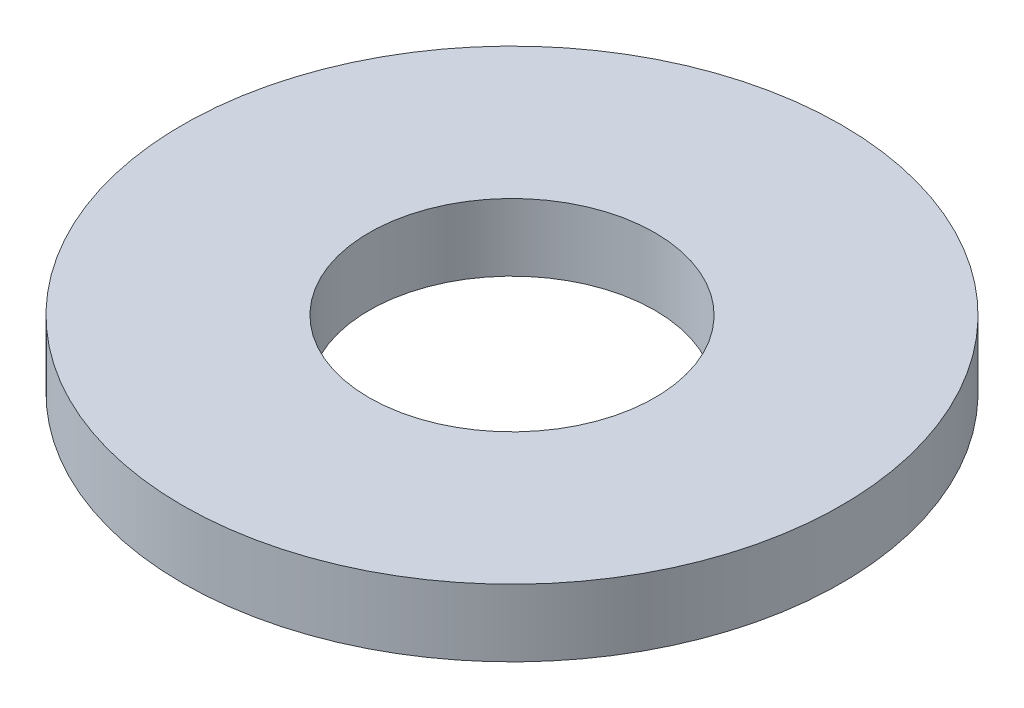
ISO-10303-21;
HEADER;
FILE_DESCRIPTION(('STEP AP214'),'2;1');
FILE_NAME('part.step','',(''),(''),'','','');
FILE_SCHEMA(('AUTOMOTIVE_DESIGN { 1 0 10303 214 1 1 1 1 }'));
ENDSEC;
DATA;
#1=APPLICATION_CONTEXT('core data for automotive mechanical design processes');
#2=APPLICATION_PROTOCOL_DEFINITION('international standard','automotive_design',2000,#1);
#3=PRODUCT_CONTEXT('',#1,'mechanical');
#4=PRODUCT('Part','Part','',(#3));
#5=PRODUCT_RELATED_PRODUCT_CATEGORY('part','',(#4));
#6=PRODUCT_DEFINITION_FORMATION('','',#4);
#7=PRODUCT_DEFINITION_CONTEXT('part definition',#1,'design');
#8=PRODUCT_DEFINITION('design','',#6,#7);
#9=PRODUCT_DEFINITION_SHAPE('','',#8);
#10=(LENGTH_UNIT() NAMED_UNIT(*) SI_UNIT(.MILLI.,.METRE.));
#11=(NAMED_UNIT(*) PLANE_ANGLE_UNIT() SI_UNIT($,.RADIAN.));
#12=(NAMED_UNIT(*) SI_UNIT($,.STERADIAN.) SOLID_ANGLE_UNIT());
#13=UNCERTAINTY_MEASURE_WITH_UNIT(LENGTH_MEASURE(1.E-05),#10,'distance_accuracy_value','');
#14=(GEOMETRIC_REPRESENTATION_CONTEXT(3) GLOBAL_UNCERTAINTY_ASSIGNED_CONTEXT((#13)) GLOBAL_UNIT_ASSIGNED_CONTEXT((#10,
#11,#12)) REPRESENTATION_CONTEXT('',''));
#15=CARTESIAN_POINT('',(0.,0.,0.));
#16=DIRECTION('',(0.,0.,1.));
#17=DIRECTION('',(1.,0.,0.));
#18=AXIS2_PLACEMENT_3D('',#15,#16,#17);
#19=CARTESIAN_POINT('',(0.,2.,0.));
#20=DIRECTION('',(0.,1.,0.));
#21=DIRECTION('',(0.,0.,1.));
#22=AXIS2_PLACEMENT_3D('',#19,#20,#21);
#23=PLANE('',#22);
#24=CARTESIAN_POINT('',(0.,2.,0.));
#25=DIRECTION('',(0.,1.,0.));
#26=DIRECTION('',(0.,0.,1.));
#27=AXIS2_PLACEMENT_3D('',#24,#25,#26);
#28=CIRCLE('',#27,9.8);
#29=CARTESIAN_POINT('',(0.,2.,9.8));
#30=VERTEX_POINT('',#29);
#31=EDGE_CURVE('E10',#30,#30,#28,.T.);
#32=ORIENTED_EDGE('',*,*,#31,.T.);
#33=EDGE_LOOP('',(#32));
#34=FACE_BOUND('',#33,.T.);
#35=CARTESIAN_POINT('',(0.,2.,0.));
#36=DIRECTION('',(0.,1.,0.));
#37=DIRECTION('',(0.,0.,1.));
#38=AXIS2_PLACEMENT_3D('',#35,#36,#37);
#39=CIRCLE('',#38,4.25);
#40=CARTESIAN_POINT('',(0.,2.,4.25));
#41=VERTEX_POINT('',#40);
#42=EDGE_CURVE('E44',#41,#41,#39,.T.);
#43=ORIENTED_EDGE('',*,*,#42,.F.);
#44=EDGE_LOOP('',(#43));
#45=FACE_BOUND('',#44,.T.);
#46=ADVANCED_FACE('F33',(#34,#45),#23,.T.);
#47=CARTESIAN_POINT('',(0.,0.,0.));
#48=DIRECTION('',(0.,1.,0.));
#49=DIRECTION('',(0.,0.,1.));
#50=AXIS2_PLACEMENT_3D('',#47,#48,#49);
#51=PLANE('',#50);
#52=CARTESIAN_POINT('',(0.,0.,0.));
#53=DIRECTION('',(0.,1.,0.));
#54=DIRECTION('',(0.,0.,1.));
#55=AXIS2_PLACEMENT_3D('',#52,#53,#54);
#56=CIRCLE('',#55,9.8);
#57=CARTESIAN_POINT('',(0.,0.,9.8));
#58=VERTEX_POINT('',#57);
#59=EDGE_CURVE('E37',#58,#58,#56,.T.);
#60=ORIENTED_EDGE('',*,*,#59,.F.);
#61=EDGE_LOOP('',(#60));
#62=FACE_BOUND('',#61,.T.);
#63=CARTESIAN_POINT('',(0.,0.,0.));
#64=DIRECTION('',(0.,1.,0.));
#65=DIRECTION('',(0.,0.,1.));
#66=AXIS2_PLACEMENT_3D('',#63,#64,#65);
#67=CIRCLE('',#66,4.25);
#68=CARTESIAN_POINT('',(0.,0.,4.25));
#69=VERTEX_POINT('',#68);
#70=EDGE_CURVE('E46',#69,#69,#67,.T.);
#71=ORIENTED_EDGE('',*,*,#70,.T.);
#72=EDGE_LOOP('',(#71));
#73=FACE_BOUND('',#72,.T.);
#74=ADVANCED_FACE('F56',(#62,#73),#51,.F.);
#75=CARTESIAN_POINT('',(0.,2.,0.));
#76=DIRECTION('',(0.,-1.,0.));
#77=DIRECTION('',(0.,0.,-1.));
#78=AXIS2_PLACEMENT_3D('',#75,#76,#77);
#79=CYLINDRICAL_SURFACE('',#78,9.8);
#80=ORIENTED_EDGE('',*,*,#31,.F.);
#81=EDGE_LOOP('',(#80));
#82=FACE_BOUND('',#81,.T.);
#83=ORIENTED_EDGE('',*,*,#59,.T.);
#84=EDGE_LOOP('',(#83));
#85=FACE_BOUND('',#84,.T.);
#86=ADVANCED_FACE('F35',(#82,#85),#79,.T.);
#87=CARTESIAN_POINT('',(0.,2.,0.));
#88=DIRECTION('',(0.,-1.,0.));
#89=DIRECTION('',(0.,0.,-1.));
#90=AXIS2_PLACEMENT_3D('',#87,#88,#89);
#91=CYLINDRICAL_SURFACE('',#90,4.25);
#92=ORIENTED_EDGE('',*,*,#42,.T.);
#93=EDGE_LOOP('',(#92));
#94=FACE_BOUND('',#93,.T.);
#95=ORIENTED_EDGE('',*,*,#70,.F.);
#96=EDGE_LOOP('',(#95));
#97=FACE_BOUND('',#96,.T.);
#98=ADVANCED_FACE('F52',(#94,#97),#91,.F.);
#99=CLOSED_SHELL('',(#46,#74,#86,#98));
#100=MANIFOLD_SOLID_BREP('B2',#99);
#101=ADVANCED_BREP_SHAPE_REPRESENTATION('',(#18,#100),#14);
#102=SHAPE_DEFINITION_REPRESENTATION(#9,#101);
ENDSEC;
END-ISO-10303-21;
